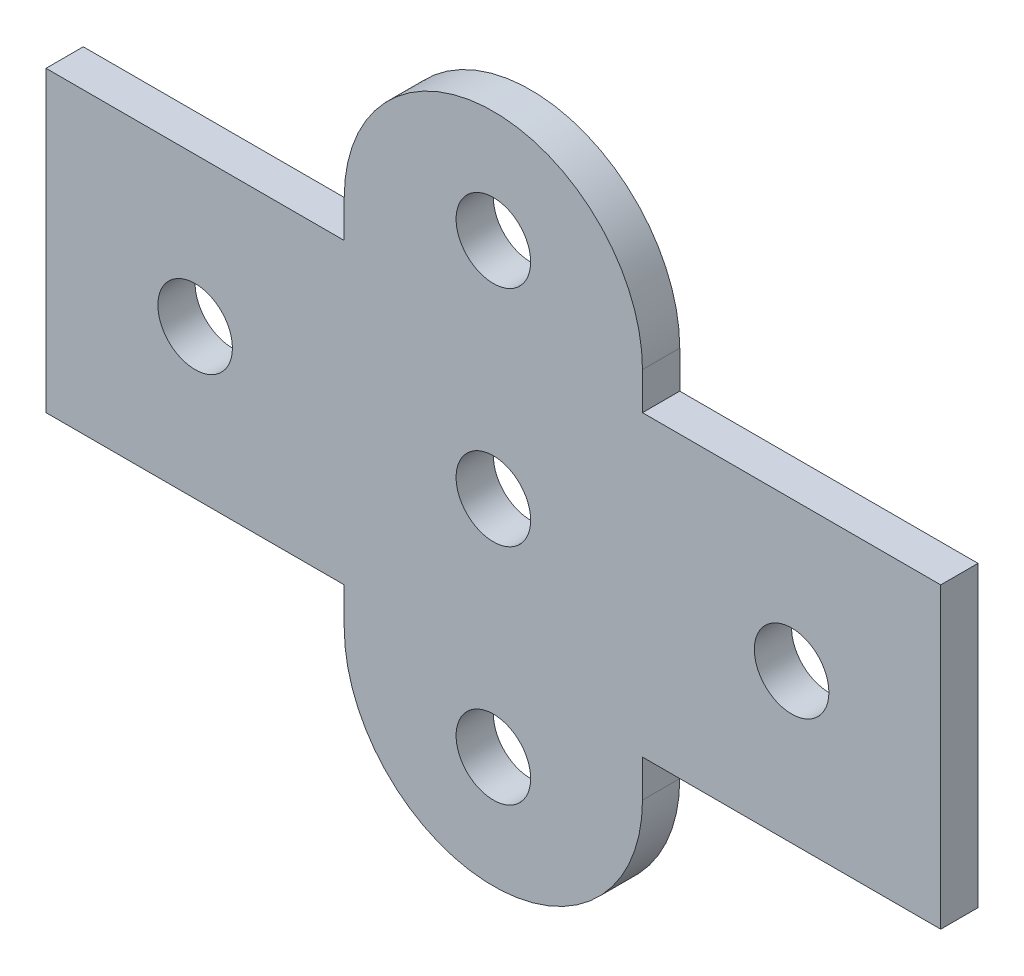
ISO-10303-21;
HEADER;
FILE_DESCRIPTION(('STEP AP214'),'2;1');
FILE_NAME('part.step','',(''),(''),'','','');
FILE_SCHEMA(('AUTOMOTIVE_DESIGN { 1 0 10303 214 1 1 1 1 }'));
ENDSEC;
DATA;
#1=APPLICATION_CONTEXT('core data for automotive mechanical design processes');
#2=APPLICATION_PROTOCOL_DEFINITION('international standard','automotive_design',2000,#1);
#3=PRODUCT_CONTEXT('',#1,'mechanical');
#4=PRODUCT('Part','Part','',(#3));
#5=PRODUCT_RELATED_PRODUCT_CATEGORY('part','',(#4));
#6=PRODUCT_DEFINITION_FORMATION('','',#4);
#7=PRODUCT_DEFINITION_CONTEXT('part definition',#1,'design');
#8=PRODUCT_DEFINITION('design','',#6,#7);
#9=PRODUCT_DEFINITION_SHAPE('','',#8);
#10=(LENGTH_UNIT() NAMED_UNIT(*) SI_UNIT(.MILLI.,.METRE.));
#11=(NAMED_UNIT(*) PLANE_ANGLE_UNIT() SI_UNIT($,.RADIAN.));
#12=(NAMED_UNIT(*) SI_UNIT($,.STERADIAN.) SOLID_ANGLE_UNIT());
#13=UNCERTAINTY_MEASURE_WITH_UNIT(LENGTH_MEASURE(1.E-05),#10,'distance_accuracy_value','');
#14=(GEOMETRIC_REPRESENTATION_CONTEXT(3) GLOBAL_UNCERTAINTY_ASSIGNED_CONTEXT((#13)) GLOBAL_UNIT_ASSIGNED_CONTEXT((#10,
#11,#12)) REPRESENTATION_CONTEXT('',''));
#15=CARTESIAN_POINT('',(0.,0.,0.));
#16=DIRECTION('',(0.,0.,1.));
#17=DIRECTION('',(1.,0.,0.));
#18=AXIS2_PLACEMENT_3D('',#15,#16,#17);
#19=CARTESIAN_POINT('',(12.7,9.525,3.175));
#20=DIRECTION('',(0.,0.,1.));
#21=DIRECTION('',(1.,0.,0.));
#22=AXIS2_PLACEMENT_3D('',#19,#20,#21);
#23=PLANE('',#22);
#24=CARTESIAN_POINT('',(38.1,25.4,3.175));
#25=DIRECTION('',(0.,0.,1.));
#26=DIRECTION('',(1.,0.,0.));
#27=AXIS2_PLACEMENT_3D('',#24,#25,#26);
#28=CIRCLE('',#27,3.175);
#29=CARTESIAN_POINT('',(41.275,25.4,3.175));
#30=VERTEX_POINT('',#29);
#31=EDGE_CURVE('E295',#30,#30,#28,.T.);
#32=ORIENTED_EDGE('',*,*,#31,.F.);
#33=EDGE_LOOP('',(#32));
#34=FACE_BOUND('',#33,.T.);
#35=CARTESIAN_POINT('',(12.7,6.35,3.175));
#36=DIRECTION('',(0.,0.,1.));
#37=DIRECTION('',(1.,0.,0.));
#38=AXIS2_PLACEMENT_3D('',#35,#36,#37);
#39=CIRCLE('',#38,3.175);
#40=CARTESIAN_POINT('',(15.875,6.35,3.175));
#41=VERTEX_POINT('',#40);
#42=EDGE_CURVE('E307',#41,#41,#39,.T.);
#43=ORIENTED_EDGE('',*,*,#42,.F.);
#44=EDGE_LOOP('',(#43));
#45=FACE_BOUND('',#44,.T.);
#46=DIRECTION('',(0.,-1.,0.));
#47=VECTOR('',#46,1.);
#48=CARTESIAN_POINT('',(0.,12.7,3.175));
#49=LINE('',#48,#47);
#50=CARTESIAN_POINT('',(0.,12.7,3.175));
#51=VERTEX_POINT('',#50);
#52=CARTESIAN_POINT('',(0.,9.525,3.175));
#53=VERTEX_POINT('',#52);
#54=EDGE_CURVE('E177',#51,#53,#49,.T.);
#55=ORIENTED_EDGE('',*,*,#54,.T.);
#56=CARTESIAN_POINT('',(12.7,9.525,3.175));
#57=DIRECTION('',(0.,0.,1.));
#58=DIRECTION('',(1.,0.,0.));
#59=AXIS2_PLACEMENT_3D('',#56,#57,#58);
#60=CIRCLE('',#59,12.7);
#61=CARTESIAN_POINT('',(25.4,9.525,3.175));
#62=VERTEX_POINT('',#61);
#63=EDGE_CURVE('E105',#53,#62,#60,.T.);
#64=ORIENTED_EDGE('',*,*,#63,.T.);
#65=DIRECTION('',(0.,1.,0.));
#66=VECTOR('',#65,1.);
#67=CARTESIAN_POINT('',(25.4,12.7,3.175));
#68=LINE('',#67,#66);
#69=CARTESIAN_POINT('',(25.4,12.7,3.175));
#70=VERTEX_POINT('',#69);
#71=EDGE_CURVE('E204',#62,#70,#68,.T.);
#72=ORIENTED_EDGE('',*,*,#71,.T.);
#73=DIRECTION('',(1.,0.,0.));
#74=VECTOR('',#73,1.);
#75=CARTESIAN_POINT('',(50.8,12.7,3.175));
#76=LINE('',#75,#74);
#77=CARTESIAN_POINT('',(50.8,12.7,3.175));
#78=VERTEX_POINT('',#77);
#79=EDGE_CURVE('E223',#70,#78,#76,.T.);
#80=ORIENTED_EDGE('',*,*,#79,.T.);
#81=DIRECTION('',(0.,1.,0.));
#82=VECTOR('',#81,1.);
#83=CARTESIAN_POINT('',(50.8,38.1,3.175));
#84=LINE('',#83,#82);
#85=CARTESIAN_POINT('',(50.8,38.1,3.175));
#86=VERTEX_POINT('',#85);
#87=EDGE_CURVE('E220',#78,#86,#84,.T.);
#88=ORIENTED_EDGE('',*,*,#87,.T.);
#89=DIRECTION('',(-1.,0.,0.));
#90=VECTOR('',#89,1.);
#91=CARTESIAN_POINT('',(25.4,38.1,3.175));
#92=LINE('',#91,#90);
#93=CARTESIAN_POINT('',(25.4,38.1,3.175));
#94=VERTEX_POINT('',#93);
#95=EDGE_CURVE('E222',#86,#94,#92,.T.);
#96=ORIENTED_EDGE('',*,*,#95,.T.);
#97=DIRECTION('',(0.,1.,0.));
#98=VECTOR('',#97,1.);
#99=CARTESIAN_POINT('',(25.4,38.1,3.175));
#100=LINE('',#99,#98);
#101=CARTESIAN_POINT('',(25.4,41.275,3.175));
#102=VERTEX_POINT('',#101);
#103=EDGE_CURVE('E225',#94,#102,#100,.T.);
#104=ORIENTED_EDGE('',*,*,#103,.T.);
#105=CARTESIAN_POINT('',(12.7,41.275,3.175));
#106=DIRECTION('',(0.,0.,1.));
#107=DIRECTION('',(-1.,0.,0.));
#108=AXIS2_PLACEMENT_3D('',#105,#106,#107);
#109=CIRCLE('',#108,12.7);
#110=CARTESIAN_POINT('',(0.,41.275,3.175));
#111=VERTEX_POINT('',#110);
#112=EDGE_CURVE('E231',#102,#111,#109,.T.);
#113=ORIENTED_EDGE('',*,*,#112,.T.);
#114=DIRECTION('',(0.,-1.,0.));
#115=VECTOR('',#114,1.);
#116=CARTESIAN_POINT('',(0.,38.1,3.175));
#117=LINE('',#116,#115);
#118=CARTESIAN_POINT('',(0.,38.1,3.175));
#119=VERTEX_POINT('',#118);
#120=EDGE_CURVE('E136',#111,#119,#117,.T.);
#121=ORIENTED_EDGE('',*,*,#120,.T.);
#122=DIRECTION('',(-1.,0.,0.));
#123=VECTOR('',#122,1.);
#124=CARTESIAN_POINT('',(0.,38.1,3.175));
#125=LINE('',#124,#123);
#126=CARTESIAN_POINT('',(-25.4,38.1,3.175));
#127=VERTEX_POINT('',#126);
#128=EDGE_CURVE('E130',#119,#127,#125,.T.);
#129=ORIENTED_EDGE('',*,*,#128,.T.);
#130=DIRECTION('',(0.,-1.,0.));
#131=VECTOR('',#130,1.);
#132=CARTESIAN_POINT('',(-25.4,38.1,3.175));
#133=LINE('',#132,#131);
#134=CARTESIAN_POINT('',(-25.4,12.7,3.175));
#135=VERTEX_POINT('',#134);
#136=EDGE_CURVE('E134',#127,#135,#133,.T.);
#137=ORIENTED_EDGE('',*,*,#136,.T.);
#138=DIRECTION('',(1.,0.,0.));
#139=VECTOR('',#138,1.);
#140=CARTESIAN_POINT('',(-25.4,12.7,3.175));
#141=LINE('',#140,#139);
#142=EDGE_CURVE('E50',#135,#51,#141,.T.);
#143=ORIENTED_EDGE('',*,*,#142,.T.);
#144=EDGE_LOOP('',(#55,#64,#72,#80,#88,#96,#104,#113,#121,#129,#137,#143));
#145=FACE_BOUND('',#144,.T.);
#146=CARTESIAN_POINT('',(12.7,44.45,3.175));
#147=DIRECTION('',(0.,0.,1.));
#148=DIRECTION('',(1.,0.,0.));
#149=AXIS2_PLACEMENT_3D('',#146,#147,#148);
#150=CIRCLE('',#149,3.175);
#151=CARTESIAN_POINT('',(15.875,44.45,3.175));
#152=VERTEX_POINT('',#151);
#153=EDGE_CURVE('E158',#152,#152,#150,.T.);
#154=ORIENTED_EDGE('',*,*,#153,.F.);
#155=EDGE_LOOP('',(#154));
#156=FACE_BOUND('',#155,.T.);
#157=CARTESIAN_POINT('',(12.7,25.4,3.175));
#158=DIRECTION('',(0.,0.,1.));
#159=DIRECTION('',(1.,0.,0.));
#160=AXIS2_PLACEMENT_3D('',#157,#158,#159);
#161=CIRCLE('',#160,3.175);
#162=CARTESIAN_POINT('',(15.875,25.4,3.175));
#163=VERTEX_POINT('',#162);
#164=EDGE_CURVE('E301',#163,#163,#161,.T.);
#165=ORIENTED_EDGE('',*,*,#164,.F.);
#166=EDGE_LOOP('',(#165));
#167=FACE_BOUND('',#166,.T.);
#168=CARTESIAN_POINT('',(-12.7,25.4,3.175));
#169=DIRECTION('',(0.,0.,1.));
#170=DIRECTION('',(1.,0.,0.));
#171=AXIS2_PLACEMENT_3D('',#168,#169,#170);
#172=CIRCLE('',#171,3.175);
#173=CARTESIAN_POINT('',(-9.525,25.4,3.175));
#174=VERTEX_POINT('',#173);
#175=EDGE_CURVE('E286',#174,#174,#172,.T.);
#176=ORIENTED_EDGE('',*,*,#175,.F.);
#177=EDGE_LOOP('',(#176));
#178=FACE_BOUND('',#177,.T.);
#179=ADVANCED_FACE('F33',(#34,#45,#145,#156,#167,#178),#23,.T.);
#180=CARTESIAN_POINT('',(12.7,9.525,0.));
#181=DIRECTION('',(0.,0.,1.));
#182=DIRECTION('',(1.,0.,0.));
#183=AXIS2_PLACEMENT_3D('',#180,#181,#182);
#184=PLANE('',#183);
#185=DIRECTION('',(0.,-1.,0.));
#186=VECTOR('',#185,1.);
#187=CARTESIAN_POINT('',(0.,12.7,0.));
#188=LINE('',#187,#186);
#189=CARTESIAN_POINT('',(0.,12.7,0.));
#190=VERTEX_POINT('',#189);
#191=CARTESIAN_POINT('',(0.,9.525,0.));
#192=VERTEX_POINT('',#191);
#193=EDGE_CURVE('E154',#190,#192,#188,.T.);
#194=ORIENTED_EDGE('',*,*,#193,.F.);
#195=DIRECTION('',(1.,0.,0.));
#196=VECTOR('',#195,1.);
#197=CARTESIAN_POINT('',(-25.4,12.7,0.));
#198=LINE('',#197,#196);
#199=CARTESIAN_POINT('',(-25.4,12.7,0.));
#200=VERTEX_POINT('',#199);
#201=EDGE_CURVE('E97',#200,#190,#198,.T.);
#202=ORIENTED_EDGE('',*,*,#201,.F.);
#203=DIRECTION('',(0.,-1.,0.));
#204=VECTOR('',#203,1.);
#205=CARTESIAN_POINT('',(-25.4,38.1,0.));
#206=LINE('',#205,#204);
#207=CARTESIAN_POINT('',(-25.4,38.1,0.));
#208=VERTEX_POINT('',#207);
#209=EDGE_CURVE('E91',#208,#200,#206,.T.);
#210=ORIENTED_EDGE('',*,*,#209,.F.);
#211=DIRECTION('',(-1.,0.,0.));
#212=VECTOR('',#211,1.);
#213=CARTESIAN_POINT('',(0.,38.1,0.));
#214=LINE('',#213,#212);
#215=CARTESIAN_POINT('',(0.,38.1,0.));
#216=VERTEX_POINT('',#215);
#217=EDGE_CURVE('E144',#216,#208,#214,.T.);
#218=ORIENTED_EDGE('',*,*,#217,.F.);
#219=DIRECTION('',(0.,-1.,0.));
#220=VECTOR('',#219,1.);
#221=CARTESIAN_POINT('',(0.,38.1,0.));
#222=LINE('',#221,#220);
#223=CARTESIAN_POINT('',(0.,41.275,0.));
#224=VERTEX_POINT('',#223);
#225=EDGE_CURVE('E172',#224,#216,#222,.T.);
#226=ORIENTED_EDGE('',*,*,#225,.F.);
#227=CARTESIAN_POINT('',(12.7,41.275,0.));
#228=DIRECTION('',(0.,0.,1.));
#229=DIRECTION('',(-1.,0.,0.));
#230=AXIS2_PLACEMENT_3D('',#227,#228,#229);
#231=CIRCLE('',#230,12.7);
#232=CARTESIAN_POINT('',(25.4,41.275,0.));
#233=VERTEX_POINT('',#232);
#234=EDGE_CURVE('E170',#233,#224,#231,.T.);
#235=ORIENTED_EDGE('',*,*,#234,.F.);
#236=DIRECTION('',(0.,1.,0.));
#237=VECTOR('',#236,1.);
#238=CARTESIAN_POINT('',(25.4,38.1,0.));
#239=LINE('',#238,#237);
#240=CARTESIAN_POINT('',(25.4,38.1,0.));
#241=VERTEX_POINT('',#240);
#242=EDGE_CURVE('E168',#241,#233,#239,.T.);
#243=ORIENTED_EDGE('',*,*,#242,.F.);
#244=DIRECTION('',(-1.,0.,0.));
#245=VECTOR('',#244,1.);
#246=CARTESIAN_POINT('',(25.4,38.1,0.));
#247=LINE('',#246,#245);
#248=CARTESIAN_POINT('',(50.8,38.1,0.));
#249=VERTEX_POINT('',#248);
#250=EDGE_CURVE('E166',#249,#241,#247,.T.);
#251=ORIENTED_EDGE('',*,*,#250,.F.);
#252=DIRECTION('',(0.,1.,0.));
#253=VECTOR('',#252,1.);
#254=CARTESIAN_POINT('',(50.8,38.1,0.));
#255=LINE('',#254,#253);
#256=CARTESIAN_POINT('',(50.8,12.7,0.));
#257=VERTEX_POINT('',#256);
#258=EDGE_CURVE('E164',#257,#249,#255,.T.);
#259=ORIENTED_EDGE('',*,*,#258,.F.);
#260=DIRECTION('',(1.,0.,0.));
#261=VECTOR('',#260,1.);
#262=CARTESIAN_POINT('',(50.8,12.7,0.));
#263=LINE('',#262,#261);
#264=CARTESIAN_POINT('',(25.4,12.7,0.));
#265=VERTEX_POINT('',#264);
#266=EDGE_CURVE('E162',#265,#257,#263,.T.);
#267=ORIENTED_EDGE('',*,*,#266,.F.);
#268=DIRECTION('',(0.,1.,0.));
#269=VECTOR('',#268,1.);
#270=CARTESIAN_POINT('',(25.4,12.7,0.));
#271=LINE('',#270,#269);
#272=CARTESIAN_POINT('',(25.4,9.525,0.));
#273=VERTEX_POINT('',#272);
#274=EDGE_CURVE('E160',#273,#265,#271,.T.);
#275=ORIENTED_EDGE('',*,*,#274,.F.);
#276=CARTESIAN_POINT('',(12.7,9.525,0.));
#277=DIRECTION('',(0.,0.,1.));
#278=DIRECTION('',(1.,0.,0.));
#279=AXIS2_PLACEMENT_3D('',#276,#277,#278);
#280=CIRCLE('',#279,12.7);
#281=EDGE_CURVE('E157',#192,#273,#280,.T.);
#282=ORIENTED_EDGE('',*,*,#281,.F.);
#283=EDGE_LOOP('',(#194,#202,#210,#218,#226,#235,#243,#251,#259,#267,#275,#282));
#284=FACE_BOUND('',#283,.T.);
#285=CARTESIAN_POINT('',(12.7,44.45,0.));
#286=DIRECTION('',(0.,0.,1.));
#287=DIRECTION('',(1.,0.,0.));
#288=AXIS2_PLACEMENT_3D('',#285,#286,#287);
#289=CIRCLE('',#288,3.175);
#290=CARTESIAN_POINT('',(15.875,44.45,0.));
#291=VERTEX_POINT('',#290);
#292=EDGE_CURVE('E310',#291,#291,#289,.T.);
#293=ORIENTED_EDGE('',*,*,#292,.T.);
#294=EDGE_LOOP('',(#293));
#295=FACE_BOUND('',#294,.T.);
#296=CARTESIAN_POINT('',(12.7,6.35,0.));
#297=DIRECTION('',(0.,0.,1.));
#298=DIRECTION('',(1.,0.,0.));
#299=AXIS2_PLACEMENT_3D('',#296,#297,#298);
#300=CIRCLE('',#299,3.175);
#301=CARTESIAN_POINT('',(15.875,6.35,0.));
#302=VERTEX_POINT('',#301);
#303=EDGE_CURVE('E304',#302,#302,#300,.T.);
#304=ORIENTED_EDGE('',*,*,#303,.T.);
#305=EDGE_LOOP('',(#304));
#306=FACE_BOUND('',#305,.T.);
#307=CARTESIAN_POINT('',(12.7,25.4,0.));
#308=DIRECTION('',(0.,0.,1.));
#309=DIRECTION('',(1.,0.,0.));
#310=AXIS2_PLACEMENT_3D('',#307,#308,#309);
#311=CIRCLE('',#310,3.175);
#312=CARTESIAN_POINT('',(15.875,25.4,0.));
#313=VERTEX_POINT('',#312);
#314=EDGE_CURVE('E298',#313,#313,#311,.T.);
#315=ORIENTED_EDGE('',*,*,#314,.T.);
#316=EDGE_LOOP('',(#315));
#317=FACE_BOUND('',#316,.T.);
#318=CARTESIAN_POINT('',(38.1,25.4,0.));
#319=DIRECTION('',(0.,0.,1.));
#320=DIRECTION('',(1.,0.,0.));
#321=AXIS2_PLACEMENT_3D('',#318,#319,#320);
#322=CIRCLE('',#321,3.175);
#323=CARTESIAN_POINT('',(41.275,25.4,0.));
#324=VERTEX_POINT('',#323);
#325=EDGE_CURVE('E292',#324,#324,#322,.T.);
#326=ORIENTED_EDGE('',*,*,#325,.T.);
#327=EDGE_LOOP('',(#326));
#328=FACE_BOUND('',#327,.T.);
#329=CARTESIAN_POINT('',(-12.7,25.4,0.));
#330=DIRECTION('',(0.,0.,1.));
#331=DIRECTION('',(1.,0.,0.));
#332=AXIS2_PLACEMENT_3D('',#329,#330,#331);
#333=CIRCLE('',#332,3.175);
#334=CARTESIAN_POINT('',(-9.525,25.4,0.));
#335=VERTEX_POINT('',#334);
#336=EDGE_CURVE('E289',#335,#335,#333,.T.);
#337=ORIENTED_EDGE('',*,*,#336,.T.);
#338=EDGE_LOOP('',(#337));
#339=FACE_BOUND('',#338,.T.);
#340=ADVANCED_FACE('F208',(#284,#295,#306,#317,#328,#339),#184,.F.);
#341=CARTESIAN_POINT('',(0.,12.7,3.175));
#342=DIRECTION('',(1.,0.,0.));
#343=DIRECTION('',(0.,0.,-1.));
#344=AXIS2_PLACEMENT_3D('',#341,#342,#343);
#345=PLANE('',#344);
#346=ORIENTED_EDGE('',*,*,#193,.T.);
#347=DIRECTION('',(0.,0.,-1.));
#348=VECTOR('',#347,1.);
#349=CARTESIAN_POINT('',(0.,9.525,3.175));
#350=LINE('',#349,#348);
#351=EDGE_CURVE('E11',#53,#192,#350,.T.);
#352=ORIENTED_EDGE('',*,*,#351,.F.);
#353=ORIENTED_EDGE('',*,*,#54,.F.);
#354=DIRECTION('',(0.,0.,-1.));
#355=VECTOR('',#354,1.);
#356=CARTESIAN_POINT('',(0.,12.7,3.175));
#357=LINE('',#356,#355);
#358=EDGE_CURVE('E150',#51,#190,#357,.T.);
#359=ORIENTED_EDGE('',*,*,#358,.T.);
#360=EDGE_LOOP('',(#346,#352,#353,#359));
#361=FACE_BOUND('',#360,.T.);
#362=ADVANCED_FACE('F35',(#361),#345,.F.);
#363=CARTESIAN_POINT('',(12.7,9.525,3.175));
#364=DIRECTION('',(0.,0.,-1.));
#365=DIRECTION('',(-1.,0.,0.));
#366=AXIS2_PLACEMENT_3D('',#363,#364,#365);
#367=CYLINDRICAL_SURFACE('',#366,12.7);
#368=ORIENTED_EDGE('',*,*,#281,.T.);
#369=DIRECTION('',(0.,0.,-1.));
#370=VECTOR('',#369,1.);
#371=CARTESIAN_POINT('',(25.4,9.525,3.175));
#372=LINE('',#371,#370);
#373=EDGE_CURVE('E42',#62,#273,#372,.T.);
#374=ORIENTED_EDGE('',*,*,#373,.F.);
#375=ORIENTED_EDGE('',*,*,#63,.F.);
#376=ORIENTED_EDGE('',*,*,#351,.T.);
#377=EDGE_LOOP('',(#368,#374,#375,#376));
#378=FACE_BOUND('',#377,.T.);
#379=ADVANCED_FACE('F429',(#378),#367,.T.);
#380=CARTESIAN_POINT('',(25.4,12.7,3.175));
#381=DIRECTION('',(-1.,0.,0.));
#382=DIRECTION('',(0.,0.,1.));
#383=AXIS2_PLACEMENT_3D('',#380,#381,#382);
#384=PLANE('',#383);
#385=ORIENTED_EDGE('',*,*,#274,.T.);
#386=DIRECTION('',(0.,0.,-1.));
#387=VECTOR('',#386,1.);
#388=CARTESIAN_POINT('',(25.4,12.7,3.175));
#389=LINE('',#388,#387);
#390=EDGE_CURVE('E196',#70,#265,#389,.T.);
#391=ORIENTED_EDGE('',*,*,#390,.F.);
#392=ORIENTED_EDGE('',*,*,#71,.F.);
#393=ORIENTED_EDGE('',*,*,#373,.T.);
#394=EDGE_LOOP('',(#385,#391,#392,#393));
#395=FACE_BOUND('',#394,.T.);
#396=ADVANCED_FACE('F202',(#395),#384,.F.);
#397=CARTESIAN_POINT('',(50.8,12.7,3.175));
#398=DIRECTION('',(0.,1.,0.));
#399=DIRECTION('',(0.,0.,1.));
#400=AXIS2_PLACEMENT_3D('',#397,#398,#399);
#401=PLANE('',#400);
#402=ORIENTED_EDGE('',*,*,#266,.T.);
#403=DIRECTION('',(0.,0.,-1.));
#404=VECTOR('',#403,1.);
#405=CARTESIAN_POINT('',(50.8,12.7,3.175));
#406=LINE('',#405,#404);
#407=EDGE_CURVE('E193',#78,#257,#406,.T.);
#408=ORIENTED_EDGE('',*,*,#407,.F.);
#409=ORIENTED_EDGE('',*,*,#79,.F.);
#410=ORIENTED_EDGE('',*,*,#390,.T.);
#411=EDGE_LOOP('',(#402,#408,#409,#410));
#412=FACE_BOUND('',#411,.T.);
#413=ADVANCED_FACE('F214',(#412),#401,.F.);
#414=CARTESIAN_POINT('',(50.8,38.1,3.175));
#415=DIRECTION('',(-1.,0.,0.));
#416=DIRECTION('',(0.,0.,1.));
#417=AXIS2_PLACEMENT_3D('',#414,#415,#416);
#418=PLANE('',#417);
#419=ORIENTED_EDGE('',*,*,#258,.T.);
#420=DIRECTION('',(0.,0.,-1.));
#421=VECTOR('',#420,1.);
#422=CARTESIAN_POINT('',(50.8,38.1,3.175));
#423=LINE('',#422,#421);
#424=EDGE_CURVE('E190',#86,#249,#423,.T.);
#425=ORIENTED_EDGE('',*,*,#424,.F.);
#426=ORIENTED_EDGE('',*,*,#87,.F.);
#427=ORIENTED_EDGE('',*,*,#407,.T.);
#428=EDGE_LOOP('',(#419,#425,#426,#427));
#429=FACE_BOUND('',#428,.T.);
#430=ADVANCED_FACE('F218',(#429),#418,.F.);
#431=CARTESIAN_POINT('',(25.4,38.1,3.175));
#432=DIRECTION('',(0.,-1.,0.));
#433=DIRECTION('',(0.,0.,-1.));
#434=AXIS2_PLACEMENT_3D('',#431,#432,#433);
#435=PLANE('',#434);
#436=ORIENTED_EDGE('',*,*,#250,.T.);
#437=DIRECTION('',(0.,0.,-1.));
#438=VECTOR('',#437,1.);
#439=CARTESIAN_POINT('',(25.4,38.1,3.175));
#440=LINE('',#439,#438);
#441=EDGE_CURVE('E187',#94,#241,#440,.T.);
#442=ORIENTED_EDGE('',*,*,#441,.F.);
#443=ORIENTED_EDGE('',*,*,#95,.F.);
#444=ORIENTED_EDGE('',*,*,#424,.T.);
#445=EDGE_LOOP('',(#436,#442,#443,#444));
#446=FACE_BOUND('',#445,.T.);
#447=ADVANCED_FACE('F394',(#446),#435,.F.);
#448=CARTESIAN_POINT('',(25.4,38.1,3.175));
#449=DIRECTION('',(-1.,0.,0.));
#450=DIRECTION('',(0.,0.,1.));
#451=AXIS2_PLACEMENT_3D('',#448,#449,#450);
#452=PLANE('',#451);
#453=ORIENTED_EDGE('',*,*,#242,.T.);
#454=DIRECTION('',(0.,0.,-1.));
#455=VECTOR('',#454,1.);
#456=CARTESIAN_POINT('',(25.4,41.275,3.175));
#457=LINE('',#456,#455);
#458=EDGE_CURVE('E184',#102,#233,#457,.T.);
#459=ORIENTED_EDGE('',*,*,#458,.F.);
#460=ORIENTED_EDGE('',*,*,#103,.F.);
#461=ORIENTED_EDGE('',*,*,#441,.T.);
#462=EDGE_LOOP('',(#453,#459,#460,#461));
#463=FACE_BOUND('',#462,.T.);
#464=ADVANCED_FACE('F385',(#463),#452,.F.);
#465=CARTESIAN_POINT('',(12.7,41.275,3.175));
#466=DIRECTION('',(0.,0.,-1.));
#467=DIRECTION('',(-1.,0.,0.));
#468=AXIS2_PLACEMENT_3D('',#465,#466,#467);
#469=CYLINDRICAL_SURFACE('',#468,12.7);
#470=ORIENTED_EDGE('',*,*,#234,.T.);
#471=DIRECTION('',(0.,0.,-1.));
#472=VECTOR('',#471,1.);
#473=CARTESIAN_POINT('',(0.,41.275,3.175));
#474=LINE('',#473,#472);
#475=EDGE_CURVE('E181',#111,#224,#474,.T.);
#476=ORIENTED_EDGE('',*,*,#475,.F.);
#477=ORIENTED_EDGE('',*,*,#112,.F.);
#478=ORIENTED_EDGE('',*,*,#458,.T.);
#479=EDGE_LOOP('',(#470,#476,#477,#478));
#480=FACE_BOUND('',#479,.T.);
#481=ADVANCED_FACE('F237',(#480),#469,.T.);
#482=CARTESIAN_POINT('',(0.,38.1,3.175));
#483=DIRECTION('',(1.,0.,0.));
#484=DIRECTION('',(0.,1.,0.));
#485=AXIS2_PLACEMENT_3D('',#482,#483,#484);
#486=PLANE('',#485);
#487=ORIENTED_EDGE('',*,*,#225,.T.);
#488=DIRECTION('',(0.,0.,-1.));
#489=VECTOR('',#488,1.);
#490=CARTESIAN_POINT('',(0.,38.1,3.175));
#491=LINE('',#490,#489);
#492=EDGE_CURVE('E145',#119,#216,#491,.T.);
#493=ORIENTED_EDGE('',*,*,#492,.F.);
#494=ORIENTED_EDGE('',*,*,#120,.F.);
#495=ORIENTED_EDGE('',*,*,#475,.T.);
#496=EDGE_LOOP('',(#487,#493,#494,#495));
#497=FACE_BOUND('',#496,.T.);
#498=ADVANCED_FACE('F241',(#497),#486,.F.);
#499=CARTESIAN_POINT('',(0.,38.1,3.175));
#500=DIRECTION('',(0.,-1.,0.));
#501=DIRECTION('',(0.,0.,-1.));
#502=AXIS2_PLACEMENT_3D('',#499,#500,#501);
#503=PLANE('',#502);
#504=ORIENTED_EDGE('',*,*,#217,.T.);
#505=DIRECTION('',(0.,0.,-1.));
#506=VECTOR('',#505,1.);
#507=CARTESIAN_POINT('',(-25.4,38.1,3.175));
#508=LINE('',#507,#506);
#509=EDGE_CURVE('E141',#127,#208,#508,.T.);
#510=ORIENTED_EDGE('',*,*,#509,.F.);
#511=ORIENTED_EDGE('',*,*,#128,.F.);
#512=ORIENTED_EDGE('',*,*,#492,.T.);
#513=EDGE_LOOP('',(#504,#510,#511,#512));
#514=FACE_BOUND('',#513,.T.);
#515=ADVANCED_FACE('F142',(#514),#503,.F.);
#516=CARTESIAN_POINT('',(-25.4,38.1,3.175));
#517=DIRECTION('',(1.,0.,0.));
#518=DIRECTION('',(0.,1.,0.));
#519=AXIS2_PLACEMENT_3D('',#516,#517,#518);
#520=PLANE('',#519);
#521=ORIENTED_EDGE('',*,*,#209,.T.);
#522=DIRECTION('',(0.,0.,-1.));
#523=VECTOR('',#522,1.);
#524=CARTESIAN_POINT('',(-25.4,12.7,3.175));
#525=LINE('',#524,#523);
#526=EDGE_CURVE('E146',#135,#200,#525,.T.);
#527=ORIENTED_EDGE('',*,*,#526,.F.);
#528=ORIENTED_EDGE('',*,*,#136,.F.);
#529=ORIENTED_EDGE('',*,*,#509,.T.);
#530=EDGE_LOOP('',(#521,#527,#528,#529));
#531=FACE_BOUND('',#530,.T.);
#532=ADVANCED_FACE('F148',(#531),#520,.F.);
#533=CARTESIAN_POINT('',(-25.4,12.7,3.175));
#534=DIRECTION('',(0.,1.,0.));
#535=DIRECTION('',(0.,0.,1.));
#536=AXIS2_PLACEMENT_3D('',#533,#534,#535);
#537=PLANE('',#536);
#538=ORIENTED_EDGE('',*,*,#201,.T.);
#539=ORIENTED_EDGE('',*,*,#358,.F.);
#540=ORIENTED_EDGE('',*,*,#142,.F.);
#541=ORIENTED_EDGE('',*,*,#526,.T.);
#542=EDGE_LOOP('',(#538,#539,#540,#541));
#543=FACE_BOUND('',#542,.T.);
#544=ADVANCED_FACE('F245',(#543),#537,.F.);
#545=CARTESIAN_POINT('',(12.7,44.45,3.175));
#546=DIRECTION('',(0.,0.,-1.));
#547=DIRECTION('',(-1.,0.,0.));
#548=AXIS2_PLACEMENT_3D('',#545,#546,#547);
#549=CYLINDRICAL_SURFACE('',#548,3.175);
#550=ORIENTED_EDGE('',*,*,#153,.T.);
#551=EDGE_LOOP('',(#550));
#552=FACE_BOUND('',#551,.T.);
#553=ORIENTED_EDGE('',*,*,#292,.F.);
#554=EDGE_LOOP('',(#553));
#555=FACE_BOUND('',#554,.T.);
#556=ADVANCED_FACE('F247',(#552,#555),#549,.F.);
#557=CARTESIAN_POINT('',(12.7,6.35,3.175));
#558=DIRECTION('',(0.,0.,-1.));
#559=DIRECTION('',(-1.,0.,0.));
#560=AXIS2_PLACEMENT_3D('',#557,#558,#559);
#561=CYLINDRICAL_SURFACE('',#560,3.175);
#562=ORIENTED_EDGE('',*,*,#42,.T.);
#563=EDGE_LOOP('',(#562));
#564=FACE_BOUND('',#563,.T.);
#565=ORIENTED_EDGE('',*,*,#303,.F.);
#566=EDGE_LOOP('',(#565));
#567=FACE_BOUND('',#566,.T.);
#568=ADVANCED_FACE('F253',(#564,#567),#561,.F.);
#569=CARTESIAN_POINT('',(12.7,25.4,3.175));
#570=DIRECTION('',(0.,0.,-1.));
#571=DIRECTION('',(-1.,0.,0.));
#572=AXIS2_PLACEMENT_3D('',#569,#570,#571);
#573=CYLINDRICAL_SURFACE('',#572,3.175);
#574=ORIENTED_EDGE('',*,*,#164,.T.);
#575=EDGE_LOOP('',(#574));
#576=FACE_BOUND('',#575,.T.);
#577=ORIENTED_EDGE('',*,*,#314,.F.);
#578=EDGE_LOOP('',(#577));
#579=FACE_BOUND('',#578,.T.);
#580=ADVANCED_FACE('F269',(#576,#579),#573,.F.);
#581=CARTESIAN_POINT('',(38.1,25.4,3.175));
#582=DIRECTION('',(0.,0.,-1.));
#583=DIRECTION('',(-1.,0.,0.));
#584=AXIS2_PLACEMENT_3D('',#581,#582,#583);
#585=CYLINDRICAL_SURFACE('',#584,3.175);
#586=ORIENTED_EDGE('',*,*,#31,.T.);
#587=EDGE_LOOP('',(#586));
#588=FACE_BOUND('',#587,.T.);
#589=ORIENTED_EDGE('',*,*,#325,.F.);
#590=EDGE_LOOP('',(#589));
#591=FACE_BOUND('',#590,.T.);
#592=ADVANCED_FACE('F273',(#588,#591),#585,.F.);
#593=CARTESIAN_POINT('',(-12.7,25.4,3.175));
#594=DIRECTION('',(0.,0.,-1.));
#595=DIRECTION('',(-1.,0.,0.));
#596=AXIS2_PLACEMENT_3D('',#593,#594,#595);
#597=CYLINDRICAL_SURFACE('',#596,3.175);
#598=ORIENTED_EDGE('',*,*,#175,.T.);
#599=EDGE_LOOP('',(#598));
#600=FACE_BOUND('',#599,.T.);
#601=ORIENTED_EDGE('',*,*,#336,.F.);
#602=EDGE_LOOP('',(#601));
#603=FACE_BOUND('',#602,.T.);
#604=ADVANCED_FACE('F277',(#600,#603),#597,.F.);
#605=CLOSED_SHELL('',(#179,#340,#362,#379,#396,#413,#430,#447,#464,#481,#498,#515,#532,#544,
#556,#568,#580,#592,#604));
#606=MANIFOLD_SOLID_BREP('B2',#605);
#607=ADVANCED_BREP_SHAPE_REPRESENTATION('',(#18,#606),#14);
#608=SHAPE_DEFINITION_REPRESENTATION(#9,#607);
ENDSEC;
END-ISO-10303-21;
